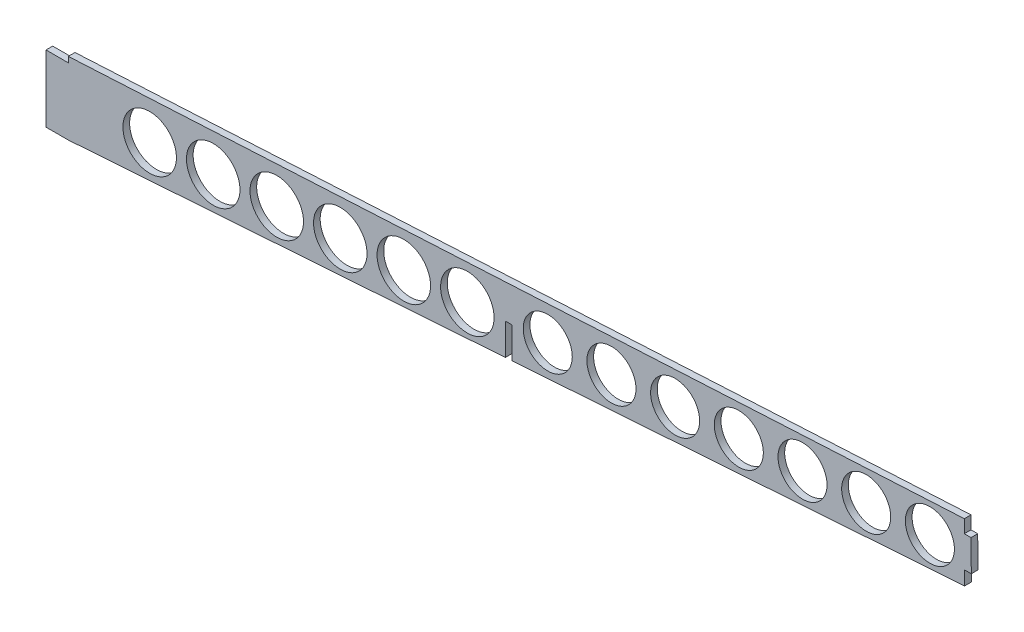
ISO-10303-21;
HEADER;
FILE_DESCRIPTION(('STEP AP214'),'2;1');
FILE_NAME('part.step','',(''),(''),'','','');
FILE_SCHEMA(('AUTOMOTIVE_DESIGN { 1 0 10303 214 1 1 1 1 }'));
ENDSEC;
DATA;
#1=APPLICATION_CONTEXT('core data for automotive mechanical design processes');
#2=APPLICATION_PROTOCOL_DEFINITION('international standard','automotive_design',2000,#1);
#3=PRODUCT_CONTEXT('',#1,'mechanical');
#4=PRODUCT('Part','Part','',(#3));
#5=PRODUCT_RELATED_PRODUCT_CATEGORY('part','',(#4));
#6=PRODUCT_DEFINITION_FORMATION('','',#4);
#7=PRODUCT_DEFINITION_CONTEXT('part definition',#1,'design');
#8=PRODUCT_DEFINITION('design','',#6,#7);
#9=PRODUCT_DEFINITION_SHAPE('','',#8);
#10=(LENGTH_UNIT() NAMED_UNIT(*) SI_UNIT(.MILLI.,.METRE.));
#11=(NAMED_UNIT(*) PLANE_ANGLE_UNIT() SI_UNIT($,.RADIAN.));
#12=(NAMED_UNIT(*) SI_UNIT($,.STERADIAN.) SOLID_ANGLE_UNIT());
#13=UNCERTAINTY_MEASURE_WITH_UNIT(LENGTH_MEASURE(1.E-05),#10,'distance_accuracy_value','');
#14=(GEOMETRIC_REPRESENTATION_CONTEXT(3) GLOBAL_UNCERTAINTY_ASSIGNED_CONTEXT((#13)) GLOBAL_UNIT_ASSIGNED_CONTEXT((#10,
#11,#12)) REPRESENTATION_CONTEXT('',''));
#15=CARTESIAN_POINT('',(0.,0.,0.));
#16=DIRECTION('',(0.,0.,1.));
#17=DIRECTION('',(1.,0.,0.));
#18=AXIS2_PLACEMENT_3D('',#15,#16,#17);
#19=CARTESIAN_POINT('',(-405.,0.,3.));
#20=DIRECTION('',(-0.0690223672970144,0.997615112562313,0.));
#21=DIRECTION('',(-0.997615112562313,-0.0690223672970144,0.));
#22=AXIS2_PLACEMENT_3D('',#19,#20,#21);
#23=PLANE('',#22);
#24=DIRECTION('',(0.997615112562313,0.0690223672970144,0.));
#25=VECTOR('',#24,1.);
#26=CARTESIAN_POINT('',(-405.,0.,0.));
#27=LINE('',#26,#25);
#28=CARTESIAN_POINT('',(-206.,13.7682869065879,0.));
#29=VERTEX_POINT('',#28);
#30=CARTESIAN_POINT('',(-3.059035659361,27.8092387766458,0.));
#31=VERTEX_POINT('',#30);
#32=EDGE_CURVE('E182',#29,#31,#27,.T.);
#33=ORIENTED_EDGE('',*,*,#32,.T.);
#34=DIRECTION('',(0.,0.,1.));
#35=VECTOR('',#34,1.);
#36=CARTESIAN_POINT('',(-3.059035659361,27.8092387766458,-7.));
#37=LINE('',#36,#35);
#38=CARTESIAN_POINT('',(-3.059035659361,27.8092387766458,3.));
#39=VERTEX_POINT('',#38);
#40=EDGE_CURVE('E254',#31,#39,#37,.T.);
#41=ORIENTED_EDGE('',*,*,#40,.T.);
#42=DIRECTION('',(0.997615112562313,0.0690223672970144,0.));
#43=VECTOR('',#42,1.);
#44=CARTESIAN_POINT('',(-405.,0.,3.));
#45=LINE('',#44,#43);
#46=CARTESIAN_POINT('',(-206.,13.7682869065879,3.));
#47=VERTEX_POINT('',#46);
#48=EDGE_CURVE('E234',#47,#39,#45,.T.);
#49=ORIENTED_EDGE('',*,*,#48,.F.);
#50=DIRECTION('',(0.,0.,-1.));
#51=VECTOR('',#50,1.);
#52=CARTESIAN_POINT('',(-206.,13.7682869065879,3.));
#53=LINE('',#52,#51);
#54=EDGE_CURVE('E252',#47,#29,#53,.T.);
#55=ORIENTED_EDGE('',*,*,#54,.T.);
#56=EDGE_LOOP('',(#33,#41,#49,#55));
#57=FACE_BOUND('',#56,.T.);
#58=ADVANCED_FACE('F37',(#57),#23,.F.);
#59=CARTESIAN_POINT('',(-415.,30.,3.));
#60=DIRECTION('',(0.,-1.,0.));
#61=DIRECTION('',(0.,0.,-1.));
#62=AXIS2_PLACEMENT_3D('',#59,#60,#61);
#63=PLANE('',#62);
#64=DIRECTION('',(-1.,0.,0.));
#65=VECTOR('',#64,1.);
#66=CARTESIAN_POINT('',(-415.,30.,0.));
#67=LINE('',#66,#65);
#68=CARTESIAN_POINT('',(-405.,30.,0.));
#69=VERTEX_POINT('',#68);
#70=CARTESIAN_POINT('',(-415.,30.,0.));
#71=VERTEX_POINT('',#70);
#72=EDGE_CURVE('E174',#69,#71,#67,.T.);
#73=ORIENTED_EDGE('',*,*,#72,.T.);
#74=DIRECTION('',(0.,0.,-1.));
#75=VECTOR('',#74,1.);
#76=CARTESIAN_POINT('',(-415.,30.,3.));
#77=LINE('',#76,#75);
#78=CARTESIAN_POINT('',(-415.,30.,3.));
#79=VERTEX_POINT('',#78);
#80=EDGE_CURVE('E203',#79,#71,#77,.T.);
#81=ORIENTED_EDGE('',*,*,#80,.F.);
#82=DIRECTION('',(-1.,0.,0.));
#83=VECTOR('',#82,1.);
#84=CARTESIAN_POINT('',(-415.,30.,3.));
#85=LINE('',#84,#83);
#86=CARTESIAN_POINT('',(-405.,30.,3.));
#87=VERTEX_POINT('',#86);
#88=EDGE_CURVE('E193',#87,#79,#85,.T.);
#89=ORIENTED_EDGE('',*,*,#88,.F.);
#90=DIRECTION('',(0.,0.,-1.));
#91=VECTOR('',#90,1.);
#92=CARTESIAN_POINT('',(-405.,30.,3.));
#93=LINE('',#92,#91);
#94=EDGE_CURVE('E168',#87,#69,#93,.T.);
#95=ORIENTED_EDGE('',*,*,#94,.T.);
#96=EDGE_LOOP('',(#73,#81,#89,#95));
#97=FACE_BOUND('',#96,.T.);
#98=ADVANCED_FACE('F39',(#97),#63,.F.);
#99=CARTESIAN_POINT('',(-415.,0.,3.));
#100=DIRECTION('',(1.,0.,0.));
#101=DIRECTION('',(0.,0.,-1.));
#102=AXIS2_PLACEMENT_3D('',#99,#100,#101);
#103=PLANE('',#102);
#104=DIRECTION('',(0.,-1.,0.));
#105=VECTOR('',#104,1.);
#106=CARTESIAN_POINT('',(-415.,0.,0.));
#107=LINE('',#106,#105);
#108=CARTESIAN_POINT('',(-415.,0.,0.));
#109=VERTEX_POINT('',#108);
#110=EDGE_CURVE('E177',#71,#109,#107,.T.);
#111=ORIENTED_EDGE('',*,*,#110,.T.);
#112=DIRECTION('',(0.,0.,-1.));
#113=VECTOR('',#112,1.);
#114=CARTESIAN_POINT('',(-415.,0.,3.));
#115=LINE('',#114,#113);
#116=CARTESIAN_POINT('',(-415.,0.,3.));
#117=VERTEX_POINT('',#116);
#118=EDGE_CURVE('E200',#117,#109,#115,.T.);
#119=ORIENTED_EDGE('',*,*,#118,.F.);
#120=DIRECTION('',(0.,-1.,0.));
#121=VECTOR('',#120,1.);
#122=CARTESIAN_POINT('',(-415.,0.,3.));
#123=LINE('',#122,#121);
#124=EDGE_CURVE('E225',#79,#117,#123,.T.);
#125=ORIENTED_EDGE('',*,*,#124,.F.);
#126=ORIENTED_EDGE('',*,*,#80,.T.);
#127=EDGE_LOOP('',(#111,#119,#125,#126));
#128=FACE_BOUND('',#127,.T.);
#129=ADVANCED_FACE('F230',(#128),#103,.F.);
#130=CARTESIAN_POINT('',(-415.,0.,3.));
#131=DIRECTION('',(0.,1.,0.));
#132=DIRECTION('',(0.,0.,1.));
#133=AXIS2_PLACEMENT_3D('',#130,#131,#132);
#134=PLANE('',#133);
#135=DIRECTION('',(1.,0.,0.));
#136=VECTOR('',#135,1.);
#137=CARTESIAN_POINT('',(-415.,0.,0.));
#138=LINE('',#137,#136);
#139=CARTESIAN_POINT('',(-405.,0.,0.));
#140=VERTEX_POINT('',#139);
#141=EDGE_CURVE('E180',#109,#140,#138,.T.);
#142=ORIENTED_EDGE('',*,*,#141,.T.);
#143=DIRECTION('',(0.,0.,-1.));
#144=VECTOR('',#143,1.);
#145=CARTESIAN_POINT('',(-405.,0.,3.));
#146=LINE('',#145,#144);
#147=CARTESIAN_POINT('',(-405.,0.,3.));
#148=VERTEX_POINT('',#147);
#149=EDGE_CURVE('E197',#148,#140,#146,.T.);
#150=ORIENTED_EDGE('',*,*,#149,.F.);
#151=DIRECTION('',(1.,0.,0.));
#152=VECTOR('',#151,1.);
#153=CARTESIAN_POINT('',(-415.,0.,3.));
#154=LINE('',#153,#152);
#155=EDGE_CURVE('E232',#117,#148,#154,.T.);
#156=ORIENTED_EDGE('',*,*,#155,.F.);
#157=ORIENTED_EDGE('',*,*,#118,.T.);
#158=EDGE_LOOP('',(#142,#150,#156,#157));
#159=FACE_BOUND('',#158,.T.);
#160=ADVANCED_FACE('F421',(#159),#134,.F.);
#161=CARTESIAN_POINT('',(-209.,13.5607247924182,0.));
#162=VERTEX_POINT('',#161);
#163=EDGE_CURVE('E183',#140,#162,#27,.T.);
#164=ORIENTED_EDGE('',*,*,#163,.T.);
#165=DIRECTION('',(0.,0.,1.));
#166=VECTOR('',#165,1.);
#167=CARTESIAN_POINT('',(-209.,13.5607247924182,0.));
#168=LINE('',#167,#166);
#169=CARTESIAN_POINT('',(-209.,13.5607247924182,3.));
#170=VERTEX_POINT('',#169);
#171=EDGE_CURVE('E310',#162,#170,#168,.T.);
#172=ORIENTED_EDGE('',*,*,#171,.T.);
#173=EDGE_CURVE('E170',#148,#170,#45,.T.);
#174=ORIENTED_EDGE('',*,*,#173,.F.);
#175=ORIENTED_EDGE('',*,*,#149,.T.);
#176=EDGE_LOOP('',(#164,#172,#174,#175));
#177=FACE_BOUND('',#176,.T.);
#178=ADVANCED_FACE('F413',(#177),#23,.F.);
#179=CARTESIAN_POINT('',(-0.255808808264265,54.0196269565569,3.));
#180=DIRECTION('',(-0.999951597832768,-0.00983880031785636,0.));
#181=DIRECTION('',(0.00983880031785636,-0.999951597832768,0.));
#182=AXIS2_PLACEMENT_3D('',#179,#180,#181);
#183=PLANE('',#182);
#184=DIRECTION('',(-0.00983880031785636,0.999951597832768,0.));
#185=VECTOR('',#184,1.);
#186=CARTESIAN_POINT('',(-0.255808808264265,54.0196269565569,0.));
#187=LINE('',#186,#185);
#188=CARTESIAN_POINT('',(-0.0590356593609952,34.0208854129049,0.));
#189=VERTEX_POINT('',#188);
#190=CARTESIAN_POINT('',(-0.19677314890327,48.0196269565569,0.));
#191=VERTEX_POINT('',#190);
#192=EDGE_CURVE('E186',#189,#191,#187,.T.);
#193=ORIENTED_EDGE('',*,*,#192,.T.);
#194=DIRECTION('',(0.,0.,1.));
#195=VECTOR('',#194,1.);
#196=CARTESIAN_POINT('',(-0.19677314890327,48.0196269565569,-7.));
#197=LINE('',#196,#195);
#198=CARTESIAN_POINT('',(-0.19677314890327,48.0196269565569,3.));
#199=VERTEX_POINT('',#198);
#200=EDGE_CURVE('E303',#191,#199,#197,.T.);
#201=ORIENTED_EDGE('',*,*,#200,.T.);
#202=DIRECTION('',(-0.00983880031785636,0.999951597832768,0.));
#203=VECTOR('',#202,1.);
#204=CARTESIAN_POINT('',(-0.255808808264265,54.0196269565569,3.));
#205=LINE('',#204,#203);
#206=CARTESIAN_POINT('',(-0.0590356593609952,34.0208854129049,3.));
#207=VERTEX_POINT('',#206);
#208=EDGE_CURVE('E166',#207,#199,#205,.T.);
#209=ORIENTED_EDGE('',*,*,#208,.F.);
#210=DIRECTION('',(0.,0.,1.));
#211=VECTOR('',#210,1.);
#212=CARTESIAN_POINT('',(-0.0590356593609952,34.0208854129049,-7.));
#213=LINE('',#212,#211);
#214=EDGE_CURVE('E257',#189,#207,#213,.T.);
#215=ORIENTED_EDGE('',*,*,#214,.F.);
#216=EDGE_LOOP('',(#193,#201,#209,#215));
#217=FACE_BOUND('',#216,.T.);
#218=ADVANCED_FACE('F420',(#217),#183,.F.);
#219=CARTESIAN_POINT('',(-405.,32.5,3.));
#220=DIRECTION('',(0.0530934723704851,-0.998589546906858,0.));
#221=DIRECTION('',(0.998589546906858,0.0530934723704851,0.));
#222=AXIS2_PLACEMENT_3D('',#219,#220,#221);
#223=PLANE('',#222);
#224=DIRECTION('',(-0.998589546906858,-0.0530934723704851,0.));
#225=VECTOR('',#224,1.);
#226=CARTESIAN_POINT('',(-405.,32.5,3.));
#227=LINE('',#226,#225);
#228=CARTESIAN_POINT('',(-3.19677314890327,53.8632603999011,3.));
#229=VERTEX_POINT('',#228);
#230=CARTESIAN_POINT('',(-405.,32.5,3.));
#231=VERTEX_POINT('',#230);
#232=EDGE_CURVE('E156',#229,#231,#227,.T.);
#233=ORIENTED_EDGE('',*,*,#232,.F.);
#234=DIRECTION('',(0.,0.,1.));
#235=VECTOR('',#234,1.);
#236=CARTESIAN_POINT('',(-3.19677314890327,53.8632603999011,-7.));
#237=LINE('',#236,#235);
#238=CARTESIAN_POINT('',(-3.19677314890327,53.8632603999011,0.));
#239=VERTEX_POINT('',#238);
#240=EDGE_CURVE('E142',#239,#229,#237,.T.);
#241=ORIENTED_EDGE('',*,*,#240,.F.);
#242=DIRECTION('',(-0.998589546906858,-0.0530934723704851,0.));
#243=VECTOR('',#242,1.);
#244=CARTESIAN_POINT('',(-405.,32.5,0.));
#245=LINE('',#244,#243);
#246=CARTESIAN_POINT('',(-405.,32.5,0.));
#247=VERTEX_POINT('',#246);
#248=EDGE_CURVE('E189',#239,#247,#245,.T.);
#249=ORIENTED_EDGE('',*,*,#248,.T.);
#250=DIRECTION('',(0.,0.,-1.));
#251=VECTOR('',#250,1.);
#252=CARTESIAN_POINT('',(-405.,32.5,3.));
#253=LINE('',#252,#251);
#254=EDGE_CURVE('E163',#231,#247,#253,.T.);
#255=ORIENTED_EDGE('',*,*,#254,.F.);
#256=EDGE_LOOP('',(#233,#241,#249,#255));
#257=FACE_BOUND('',#256,.T.);
#258=ADVANCED_FACE('F161',(#257),#223,.F.);
#259=CARTESIAN_POINT('',(-405.,30.,3.));
#260=DIRECTION('',(1.,0.,0.));
#261=DIRECTION('',(0.,0.,-1.));
#262=AXIS2_PLACEMENT_3D('',#259,#260,#261);
#263=PLANE('',#262);
#264=DIRECTION('',(0.,-1.,0.));
#265=VECTOR('',#264,1.);
#266=CARTESIAN_POINT('',(-405.,30.,0.));
#267=LINE('',#266,#265);
#268=EDGE_CURVE('E191',#247,#69,#267,.T.);
#269=ORIENTED_EDGE('',*,*,#268,.T.);
#270=ORIENTED_EDGE('',*,*,#94,.F.);
#271=DIRECTION('',(0.,-1.,0.));
#272=VECTOR('',#271,1.);
#273=CARTESIAN_POINT('',(-405.,30.,3.));
#274=LINE('',#273,#272);
#275=EDGE_CURVE('E165',#231,#87,#274,.T.);
#276=ORIENTED_EDGE('',*,*,#275,.F.);
#277=ORIENTED_EDGE('',*,*,#254,.T.);
#278=EDGE_LOOP('',(#269,#270,#276,#277));
#279=FACE_BOUND('',#278,.T.);
#280=ADVANCED_FACE('F220',(#279),#263,.F.);
#281=CARTESIAN_POINT('',(0.,0.,3.));
#282=DIRECTION('',(0.,0.,1.));
#283=DIRECTION('',(1.,0.,0.));
#284=AXIS2_PLACEMENT_3D('',#281,#282,#283);
#285=PLANE('',#284);
#286=DIRECTION('',(1.,0.,0.));
#287=VECTOR('',#286,1.);
#288=CARTESIAN_POINT('',(-3.19677314890327,48.0196269565569,3.));
#289=LINE('',#288,#287);
#290=CARTESIAN_POINT('',(-3.19677314890327,48.0196269565569,3.));
#291=VERTEX_POINT('',#290);
#292=EDGE_CURVE('E151',#291,#199,#289,.T.);
#293=ORIENTED_EDGE('',*,*,#292,.F.);
#294=DIRECTION('',(0.,-1.,0.));
#295=VECTOR('',#294,1.);
#296=CARTESIAN_POINT('',(-3.19677314890327,53.8632603999011,3.));
#297=LINE('',#296,#295);
#298=EDGE_CURVE('E145',#229,#291,#297,.T.);
#299=ORIENTED_EDGE('',*,*,#298,.F.);
#300=ORIENTED_EDGE('',*,*,#232,.T.);
#301=ORIENTED_EDGE('',*,*,#275,.T.);
#302=ORIENTED_EDGE('',*,*,#88,.T.);
#303=ORIENTED_EDGE('',*,*,#124,.T.);
#304=ORIENTED_EDGE('',*,*,#155,.T.);
#305=ORIENTED_EDGE('',*,*,#173,.T.);
#306=DIRECTION('',(0.,-1.,0.));
#307=VECTOR('',#306,1.);
#308=CARTESIAN_POINT('',(-209.,0.,3.));
#309=LINE('',#308,#307);
#310=CARTESIAN_POINT('',(-209.,27.6928989485429,3.));
#311=VERTEX_POINT('',#310);
#312=EDGE_CURVE('E320',#311,#170,#309,.T.);
#313=ORIENTED_EDGE('',*,*,#312,.F.);
#314=DIRECTION('',(-1.,0.,0.));
#315=VECTOR('',#314,1.);
#316=CARTESIAN_POINT('',(0.,27.6928989485429,3.));
#317=LINE('',#316,#315);
#318=CARTESIAN_POINT('',(-206.,27.6928989485429,3.));
#319=VERTEX_POINT('',#318);
#320=EDGE_CURVE('E313',#319,#311,#317,.T.);
#321=ORIENTED_EDGE('',*,*,#320,.F.);
#322=DIRECTION('',(0.,1.,0.));
#323=VECTOR('',#322,1.);
#324=CARTESIAN_POINT('',(-206.,0.,3.));
#325=LINE('',#324,#323);
#326=EDGE_CURVE('E247',#47,#319,#325,.T.);
#327=ORIENTED_EDGE('',*,*,#326,.F.);
#328=ORIENTED_EDGE('',*,*,#48,.T.);
#329=DIRECTION('',(0.,-1.,0.));
#330=VECTOR('',#329,1.);
#331=CARTESIAN_POINT('',(-3.059035659361,27.8092387766458,3.));
#332=LINE('',#331,#330);
#333=CARTESIAN_POINT('',(-3.059035659361,34.0208854129049,3.));
#334=VERTEX_POINT('',#333);
#335=EDGE_CURVE('E245',#334,#39,#332,.T.);
#336=ORIENTED_EDGE('',*,*,#335,.F.);
#337=DIRECTION('',(-1.,0.,0.));
#338=VECTOR('',#337,1.);
#339=CARTESIAN_POINT('',(-3.059035659361,34.0208854129049,3.));
#340=LINE('',#339,#338);
#341=EDGE_CURVE('E159',#207,#334,#340,.T.);
#342=ORIENTED_EDGE('',*,*,#341,.F.);
#343=ORIENTED_EDGE('',*,*,#208,.T.);
#344=EDGE_LOOP('',(#293,#299,#300,#301,#302,#303,#304,#305,#313,#321,#327,#328,#336,#342,#343));
#345=FACE_BOUND('',#344,.T.);
#346=CARTESIAN_POINT('',(-18.634713731743,39.8308634725518,3.));
#347=DIRECTION('',(0.,0.,1.));
#348=DIRECTION('',(1.,0.,0.));
#349=AXIS2_PLACEMENT_3D('',#346,#347,#348);
#350=CIRCLE('',#349,11.);
#351=CARTESIAN_POINT('',(-7.63471373174304,39.8308634725518,3.));
#352=VERTEX_POINT('',#351);
#353=EDGE_CURVE('E178',#352,#352,#350,.T.);
#354=ORIENTED_EDGE('',*,*,#353,.F.);
#355=EDGE_LOOP('',(#354));
#356=FACE_BOUND('',#355,.T.);
#357=CARTESIAN_POINT('',(-47.1955947764526,37.995317259985,3.));
#358=DIRECTION('',(0.,0.,1.));
#359=DIRECTION('',(1.,0.,0.));
#360=AXIS2_PLACEMENT_3D('',#357,#358,#359);
#361=CIRCLE('',#360,11.);
#362=CARTESIAN_POINT('',(-36.1955947764526,37.995317259985,3.));
#363=VERTEX_POINT('',#362);
#364=EDGE_CURVE('E357',#363,#363,#361,.T.);
#365=ORIENTED_EDGE('',*,*,#364,.F.);
#366=EDGE_LOOP('',(#365));
#367=FACE_BOUND('',#366,.T.);
#368=CARTESIAN_POINT('',(-75.756475821162,36.1597710474183,3.));
#369=DIRECTION('',(0.,0.,1.));
#370=DIRECTION('',(1.,0.,0.));
#371=AXIS2_PLACEMENT_3D('',#368,#369,#370);
#372=CIRCLE('',#371,11.);
#373=CARTESIAN_POINT('',(-64.7564758211621,36.1597710474183,3.));
#374=VERTEX_POINT('',#373);
#375=EDGE_CURVE('E354',#374,#374,#372,.T.);
#376=ORIENTED_EDGE('',*,*,#375,.F.);
#377=EDGE_LOOP('',(#376));
#378=FACE_BOUND('',#377,.T.);
#379=CARTESIAN_POINT('',(-104.317356865872,34.3242248348515,3.));
#380=DIRECTION('',(0.,0.,1.));
#381=DIRECTION('',(1.,0.,0.));
#382=AXIS2_PLACEMENT_3D('',#379,#380,#381);
#383=CIRCLE('',#382,11.);
#384=CARTESIAN_POINT('',(-93.3173568658715,34.3242248348515,3.));
#385=VERTEX_POINT('',#384);
#386=EDGE_CURVE('E351',#385,#385,#383,.T.);
#387=ORIENTED_EDGE('',*,*,#386,.F.);
#388=EDGE_LOOP('',(#387));
#389=FACE_BOUND('',#388,.T.);
#390=CARTESIAN_POINT('',(-132.878237910581,32.4886786222847,3.));
#391=DIRECTION('',(0.,0.,1.));
#392=DIRECTION('',(1.,0.,0.));
#393=AXIS2_PLACEMENT_3D('',#390,#391,#392);
#394=CIRCLE('',#393,11.);
#395=CARTESIAN_POINT('',(-121.878237910581,32.4886786222847,3.));
#396=VERTEX_POINT('',#395);
#397=EDGE_CURVE('E348',#396,#396,#394,.T.);
#398=ORIENTED_EDGE('',*,*,#397,.F.);
#399=EDGE_LOOP('',(#398));
#400=FACE_BOUND('',#399,.T.);
#401=CARTESIAN_POINT('',(-161.43911895529,30.653132409718,3.));
#402=DIRECTION('',(0.,0.,1.));
#403=DIRECTION('',(1.,0.,0.));
#404=AXIS2_PLACEMENT_3D('',#401,#402,#403);
#405=CIRCLE('',#404,11.);
#406=CARTESIAN_POINT('',(-150.43911895529,30.653132409718,3.));
#407=VERTEX_POINT('',#406);
#408=EDGE_CURVE('E345',#407,#407,#405,.T.);
#409=ORIENTED_EDGE('',*,*,#408,.F.);
#410=EDGE_LOOP('',(#409));
#411=FACE_BOUND('',#410,.T.);
#412=CARTESIAN_POINT('',(-190.,28.8175861971512,3.));
#413=DIRECTION('',(0.,0.,1.));
#414=DIRECTION('',(1.,0.,0.));
#415=AXIS2_PLACEMENT_3D('',#412,#413,#414);
#416=CIRCLE('',#415,11.);
#417=CARTESIAN_POINT('',(-179.,28.8175861971512,3.));
#418=VERTEX_POINT('',#417);
#419=EDGE_CURVE('E342',#418,#418,#416,.T.);
#420=ORIENTED_EDGE('',*,*,#419,.F.);
#421=EDGE_LOOP('',(#420));
#422=FACE_BOUND('',#421,.T.);
#423=CARTESIAN_POINT('',(-226.059717716448,26.5001059283514,3.));
#424=DIRECTION('',(0.,0.,1.));
#425=DIRECTION('',(1.,0.,0.));
#426=AXIS2_PLACEMENT_3D('',#423,#424,#425);
#427=CIRCLE('',#426,12.);
#428=CARTESIAN_POINT('',(-214.059717716448,26.5001059283514,3.));
#429=VERTEX_POINT('',#428);
#430=EDGE_CURVE('E339',#429,#429,#427,.T.);
#431=ORIENTED_EDGE('',*,*,#430,.F.);
#432=EDGE_LOOP('',(#431));
#433=FACE_BOUND('',#432,.T.);
#434=CARTESIAN_POINT('',(-254.549764763706,24.6691120639961,3.));
#435=DIRECTION('',(0.,0.,1.));
#436=DIRECTION('',(1.,0.,0.));
#437=AXIS2_PLACEMENT_3D('',#434,#435,#436);
#438=CIRCLE('',#437,12.);
#439=CARTESIAN_POINT('',(-242.549764763706,24.6691120639961,3.));
#440=VERTEX_POINT('',#439);
#441=EDGE_CURVE('E336',#440,#440,#438,.T.);
#442=ORIENTED_EDGE('',*,*,#441,.F.);
#443=EDGE_LOOP('',(#442));
#444=FACE_BOUND('',#443,.T.);
#445=CARTESIAN_POINT('',(-283.039811810965,22.8381181996408,3.));
#446=DIRECTION('',(0.,0.,1.));
#447=DIRECTION('',(1.,0.,0.));
#448=AXIS2_PLACEMENT_3D('',#445,#446,#447);
#449=CIRCLE('',#448,12.);
#450=CARTESIAN_POINT('',(-271.039811810965,22.8381181996408,3.));
#451=VERTEX_POINT('',#450);
#452=EDGE_CURVE('E333',#451,#451,#449,.T.);
#453=ORIENTED_EDGE('',*,*,#452,.F.);
#454=EDGE_LOOP('',(#453));
#455=FACE_BOUND('',#454,.T.);
#456=CARTESIAN_POINT('',(-311.529858858224,21.0071243352855,3.));
#457=DIRECTION('',(0.,0.,1.));
#458=DIRECTION('',(1.,0.,0.));
#459=AXIS2_PLACEMENT_3D('',#456,#457,#458);
#460=CIRCLE('',#459,12.);
#461=CARTESIAN_POINT('',(-299.529858858224,21.0071243352855,3.));
#462=VERTEX_POINT('',#461);
#463=EDGE_CURVE('E330',#462,#462,#460,.T.);
#464=ORIENTED_EDGE('',*,*,#463,.F.);
#465=EDGE_LOOP('',(#464));
#466=FACE_BOUND('',#465,.T.);
#467=CARTESIAN_POINT('',(-340.019905905483,19.1761304709302,3.));
#468=DIRECTION('',(0.,0.,1.));
#469=DIRECTION('',(1.,0.,0.));
#470=AXIS2_PLACEMENT_3D('',#467,#468,#469);
#471=CIRCLE('',#470,12.);
#472=CARTESIAN_POINT('',(-328.019905905483,19.1761304709302,3.));
#473=VERTEX_POINT('',#472);
#474=EDGE_CURVE('E327',#473,#473,#471,.T.);
#475=ORIENTED_EDGE('',*,*,#474,.F.);
#476=EDGE_LOOP('',(#475));
#477=FACE_BOUND('',#476,.T.);
#478=CARTESIAN_POINT('',(-368.509952952741,17.3451366065749,3.));
#479=DIRECTION('',(0.,0.,1.));
#480=DIRECTION('',(1.,0.,0.));
#481=AXIS2_PLACEMENT_3D('',#478,#479,#480);
#482=CIRCLE('',#481,12.);
#483=CARTESIAN_POINT('',(-356.509952952741,17.3451366065749,3.));
#484=VERTEX_POINT('',#483);
#485=EDGE_CURVE('E324',#484,#484,#482,.T.);
#486=ORIENTED_EDGE('',*,*,#485,.F.);
#487=EDGE_LOOP('',(#486));
#488=FACE_BOUND('',#487,.T.);
#489=ADVANCED_FACE('F154',(#345,#356,#367,#378,#389,#400,#411,#422,#433,#444,#455,#466,#477,
#488),#285,.T.);
#490=CARTESIAN_POINT('',(0.,0.,0.));
#491=DIRECTION('',(0.,0.,1.));
#492=DIRECTION('',(1.,0.,0.));
#493=AXIS2_PLACEMENT_3D('',#490,#491,#492);
#494=PLANE('',#493);
#495=CARTESIAN_POINT('',(-18.634713731743,39.8308634725518,0.));
#496=DIRECTION('',(0.,0.,1.));
#497=DIRECTION('',(1.,0.,0.));
#498=AXIS2_PLACEMENT_3D('',#495,#496,#497);
#499=CIRCLE('',#498,11.);
#500=CARTESIAN_POINT('',(-7.63471373174304,39.8308634725518,0.));
#501=VERTEX_POINT('',#500);
#502=EDGE_CURVE('E300',#501,#501,#499,.T.);
#503=ORIENTED_EDGE('',*,*,#502,.T.);
#504=EDGE_LOOP('',(#503));
#505=FACE_BOUND('',#504,.T.);
#506=CARTESIAN_POINT('',(-47.1955947764526,37.995317259985,0.));
#507=DIRECTION('',(0.,0.,1.));
#508=DIRECTION('',(1.,0.,0.));
#509=AXIS2_PLACEMENT_3D('',#506,#507,#508);
#510=CIRCLE('',#509,11.);
#511=CARTESIAN_POINT('',(-36.1955947764526,37.995317259985,0.));
#512=VERTEX_POINT('',#511);
#513=EDGE_CURVE('E297',#512,#512,#510,.T.);
#514=ORIENTED_EDGE('',*,*,#513,.T.);
#515=EDGE_LOOP('',(#514));
#516=FACE_BOUND('',#515,.T.);
#517=CARTESIAN_POINT('',(-75.756475821162,36.1597710474183,0.));
#518=DIRECTION('',(0.,0.,1.));
#519=DIRECTION('',(1.,0.,0.));
#520=AXIS2_PLACEMENT_3D('',#517,#518,#519);
#521=CIRCLE('',#520,11.);
#522=CARTESIAN_POINT('',(-64.7564758211621,36.1597710474183,0.));
#523=VERTEX_POINT('',#522);
#524=EDGE_CURVE('E294',#523,#523,#521,.T.);
#525=ORIENTED_EDGE('',*,*,#524,.T.);
#526=EDGE_LOOP('',(#525));
#527=FACE_BOUND('',#526,.T.);
#528=CARTESIAN_POINT('',(-104.317356865872,34.3242248348515,0.));
#529=DIRECTION('',(0.,0.,1.));
#530=DIRECTION('',(1.,0.,0.));
#531=AXIS2_PLACEMENT_3D('',#528,#529,#530);
#532=CIRCLE('',#531,11.);
#533=CARTESIAN_POINT('',(-93.3173568658715,34.3242248348515,0.));
#534=VERTEX_POINT('',#533);
#535=EDGE_CURVE('E291',#534,#534,#532,.T.);
#536=ORIENTED_EDGE('',*,*,#535,.T.);
#537=EDGE_LOOP('',(#536));
#538=FACE_BOUND('',#537,.T.);
#539=CARTESIAN_POINT('',(-132.878237910581,32.4886786222847,0.));
#540=DIRECTION('',(0.,0.,1.));
#541=DIRECTION('',(1.,0.,0.));
#542=AXIS2_PLACEMENT_3D('',#539,#540,#541);
#543=CIRCLE('',#542,11.);
#544=CARTESIAN_POINT('',(-121.878237910581,32.4886786222847,0.));
#545=VERTEX_POINT('',#544);
#546=EDGE_CURVE('E288',#545,#545,#543,.T.);
#547=ORIENTED_EDGE('',*,*,#546,.T.);
#548=EDGE_LOOP('',(#547));
#549=FACE_BOUND('',#548,.T.);
#550=CARTESIAN_POINT('',(-161.43911895529,30.653132409718,0.));
#551=DIRECTION('',(0.,0.,1.));
#552=DIRECTION('',(1.,0.,0.));
#553=AXIS2_PLACEMENT_3D('',#550,#551,#552);
#554=CIRCLE('',#553,11.);
#555=CARTESIAN_POINT('',(-150.43911895529,30.653132409718,0.));
#556=VERTEX_POINT('',#555);
#557=EDGE_CURVE('E285',#556,#556,#554,.T.);
#558=ORIENTED_EDGE('',*,*,#557,.T.);
#559=EDGE_LOOP('',(#558));
#560=FACE_BOUND('',#559,.T.);
#561=CARTESIAN_POINT('',(-190.,28.8175861971512,0.));
#562=DIRECTION('',(0.,0.,1.));
#563=DIRECTION('',(1.,0.,0.));
#564=AXIS2_PLACEMENT_3D('',#561,#562,#563);
#565=CIRCLE('',#564,11.);
#566=CARTESIAN_POINT('',(-179.,28.8175861971512,0.));
#567=VERTEX_POINT('',#566);
#568=EDGE_CURVE('E282',#567,#567,#565,.T.);
#569=ORIENTED_EDGE('',*,*,#568,.T.);
#570=EDGE_LOOP('',(#569));
#571=FACE_BOUND('',#570,.T.);
#572=CARTESIAN_POINT('',(-226.059717716448,26.5001059283514,0.));
#573=DIRECTION('',(0.,0.,1.));
#574=DIRECTION('',(1.,0.,0.));
#575=AXIS2_PLACEMENT_3D('',#572,#573,#574);
#576=CIRCLE('',#575,12.);
#577=CARTESIAN_POINT('',(-214.059717716448,26.5001059283514,0.));
#578=VERTEX_POINT('',#577);
#579=EDGE_CURVE('E279',#578,#578,#576,.T.);
#580=ORIENTED_EDGE('',*,*,#579,.T.);
#581=EDGE_LOOP('',(#580));
#582=FACE_BOUND('',#581,.T.);
#583=CARTESIAN_POINT('',(-254.549764763706,24.6691120639961,0.));
#584=DIRECTION('',(0.,0.,1.));
#585=DIRECTION('',(1.,0.,0.));
#586=AXIS2_PLACEMENT_3D('',#583,#584,#585);
#587=CIRCLE('',#586,12.);
#588=CARTESIAN_POINT('',(-242.549764763706,24.6691120639961,0.));
#589=VERTEX_POINT('',#588);
#590=EDGE_CURVE('E276',#589,#589,#587,.T.);
#591=ORIENTED_EDGE('',*,*,#590,.T.);
#592=EDGE_LOOP('',(#591));
#593=FACE_BOUND('',#592,.T.);
#594=CARTESIAN_POINT('',(-283.039811810965,22.8381181996408,0.));
#595=DIRECTION('',(0.,0.,1.));
#596=DIRECTION('',(1.,0.,0.));
#597=AXIS2_PLACEMENT_3D('',#594,#595,#596);
#598=CIRCLE('',#597,12.);
#599=CARTESIAN_POINT('',(-271.039811810965,22.8381181996408,0.));
#600=VERTEX_POINT('',#599);
#601=EDGE_CURVE('E273',#600,#600,#598,.T.);
#602=ORIENTED_EDGE('',*,*,#601,.T.);
#603=EDGE_LOOP('',(#602));
#604=FACE_BOUND('',#603,.T.);
#605=CARTESIAN_POINT('',(-311.529858858224,21.0071243352855,0.));
#606=DIRECTION('',(0.,0.,1.));
#607=DIRECTION('',(1.,0.,0.));
#608=AXIS2_PLACEMENT_3D('',#605,#606,#607);
#609=CIRCLE('',#608,12.);
#610=CARTESIAN_POINT('',(-299.529858858224,21.0071243352855,0.));
#611=VERTEX_POINT('',#610);
#612=EDGE_CURVE('E270',#611,#611,#609,.T.);
#613=ORIENTED_EDGE('',*,*,#612,.T.);
#614=EDGE_LOOP('',(#613));
#615=FACE_BOUND('',#614,.T.);
#616=CARTESIAN_POINT('',(-340.019905905483,19.1761304709302,0.));
#617=DIRECTION('',(0.,0.,1.));
#618=DIRECTION('',(1.,0.,0.));
#619=AXIS2_PLACEMENT_3D('',#616,#617,#618);
#620=CIRCLE('',#619,12.);
#621=CARTESIAN_POINT('',(-328.019905905483,19.1761304709302,0.));
#622=VERTEX_POINT('',#621);
#623=EDGE_CURVE('E267',#622,#622,#620,.T.);
#624=ORIENTED_EDGE('',*,*,#623,.T.);
#625=EDGE_LOOP('',(#624));
#626=FACE_BOUND('',#625,.T.);
#627=CARTESIAN_POINT('',(-368.509952952741,17.3451366065749,0.));
#628=DIRECTION('',(0.,0.,1.));
#629=DIRECTION('',(1.,0.,0.));
#630=AXIS2_PLACEMENT_3D('',#627,#628,#629);
#631=CIRCLE('',#630,12.);
#632=CARTESIAN_POINT('',(-356.509952952741,17.3451366065749,0.));
#633=VERTEX_POINT('',#632);
#634=EDGE_CURVE('E263',#633,#633,#631,.T.);
#635=ORIENTED_EDGE('',*,*,#634,.T.);
#636=EDGE_LOOP('',(#635));
#637=FACE_BOUND('',#636,.T.);
#638=DIRECTION('',(0.,-1.,0.));
#639=VECTOR('',#638,1.);
#640=CARTESIAN_POINT('',(-3.19677314890326,0.,0.));
#641=LINE('',#640,#639);
#642=CARTESIAN_POINT('',(-3.19677314890327,48.0196269565569,0.));
#643=VERTEX_POINT('',#642);
#644=EDGE_CURVE('E45',#239,#643,#641,.T.);
#645=ORIENTED_EDGE('',*,*,#644,.T.);
#646=DIRECTION('',(1.,0.,0.));
#647=VECTOR('',#646,1.);
#648=CARTESIAN_POINT('',(0.,48.0196269565569,0.));
#649=LINE('',#648,#647);
#650=EDGE_CURVE('E11',#643,#191,#649,.T.);
#651=ORIENTED_EDGE('',*,*,#650,.T.);
#652=ORIENTED_EDGE('',*,*,#192,.F.);
#653=DIRECTION('',(-1.,0.,0.));
#654=VECTOR('',#653,1.);
#655=CARTESIAN_POINT('',(0.,34.0208854129049,0.));
#656=LINE('',#655,#654);
#657=CARTESIAN_POINT('',(-3.059035659361,34.0208854129049,0.));
#658=VERTEX_POINT('',#657);
#659=EDGE_CURVE('E209',#189,#658,#656,.T.);
#660=ORIENTED_EDGE('',*,*,#659,.T.);
#661=DIRECTION('',(0.,-1.,0.));
#662=VECTOR('',#661,1.);
#663=CARTESIAN_POINT('',(-3.059035659361,0.,0.));
#664=LINE('',#663,#662);
#665=EDGE_CURVE('E212',#658,#31,#664,.T.);
#666=ORIENTED_EDGE('',*,*,#665,.T.);
#667=ORIENTED_EDGE('',*,*,#32,.F.);
#668=DIRECTION('',(0.,1.,0.));
#669=VECTOR('',#668,1.);
#670=CARTESIAN_POINT('',(-206.,0.,0.));
#671=LINE('',#670,#669);
#672=CARTESIAN_POINT('',(-206.,27.6928989485429,0.));
#673=VERTEX_POINT('',#672);
#674=EDGE_CURVE('E206',#29,#673,#671,.T.);
#675=ORIENTED_EDGE('',*,*,#674,.T.);
#676=DIRECTION('',(-1.,0.,0.));
#677=VECTOR('',#676,1.);
#678=CARTESIAN_POINT('',(-209.,27.6928989485429,0.));
#679=LINE('',#678,#677);
#680=CARTESIAN_POINT('',(-209.,27.6928989485429,0.));
#681=VERTEX_POINT('',#680);
#682=EDGE_CURVE('E266',#673,#681,#679,.T.);
#683=ORIENTED_EDGE('',*,*,#682,.T.);
#684=DIRECTION('',(0.,-1.,0.));
#685=VECTOR('',#684,1.);
#686=CARTESIAN_POINT('',(-209.,27.6928989485429,0.));
#687=LINE('',#686,#685);
#688=EDGE_CURVE('E306',#681,#162,#687,.T.);
#689=ORIENTED_EDGE('',*,*,#688,.T.);
#690=ORIENTED_EDGE('',*,*,#163,.F.);
#691=ORIENTED_EDGE('',*,*,#141,.F.);
#692=ORIENTED_EDGE('',*,*,#110,.F.);
#693=ORIENTED_EDGE('',*,*,#72,.F.);
#694=ORIENTED_EDGE('',*,*,#268,.F.);
#695=ORIENTED_EDGE('',*,*,#248,.F.);
#696=EDGE_LOOP('',(#645,#651,#652,#660,#666,#667,#675,#683,#689,#690,#691,#692,#693,#694,#695));
#697=FACE_BOUND('',#696,.T.);
#698=ADVANCED_FACE('F215',(#505,#516,#527,#538,#549,#560,#571,#582,#593,#604,#615,#626,#637,
#697),#494,.F.);
#699=CARTESIAN_POINT('',(-206.,13.5607247924182,0.));
#700=DIRECTION('',(1.,0.,0.));
#701=DIRECTION('',(0.,0.,-1.));
#702=AXIS2_PLACEMENT_3D('',#699,#700,#701);
#703=PLANE('',#702);
#704=ORIENTED_EDGE('',*,*,#326,.T.);
#705=DIRECTION('',(0.,0.,1.));
#706=VECTOR('',#705,1.);
#707=CARTESIAN_POINT('',(-206.,27.6928989485429,0.));
#708=LINE('',#707,#706);
#709=EDGE_CURVE('E309',#673,#319,#708,.T.);
#710=ORIENTED_EDGE('',*,*,#709,.F.);
#711=ORIENTED_EDGE('',*,*,#674,.F.);
#712=ORIENTED_EDGE('',*,*,#54,.F.);
#713=EDGE_LOOP('',(#704,#710,#711,#712));
#714=FACE_BOUND('',#713,.T.);
#715=ADVANCED_FACE('F400',(#714),#703,.F.);
#716=CARTESIAN_POINT('',(-209.,27.6928989485429,0.));
#717=DIRECTION('',(-1.,0.,0.));
#718=DIRECTION('',(0.,0.,1.));
#719=AXIS2_PLACEMENT_3D('',#716,#717,#718);
#720=PLANE('',#719);
#721=ORIENTED_EDGE('',*,*,#312,.T.);
#722=ORIENTED_EDGE('',*,*,#171,.F.);
#723=ORIENTED_EDGE('',*,*,#688,.F.);
#724=DIRECTION('',(0.,0.,1.));
#725=VECTOR('',#724,1.);
#726=CARTESIAN_POINT('',(-209.,27.6928989485429,0.));
#727=LINE('',#726,#725);
#728=EDGE_CURVE('E314',#681,#311,#727,.T.);
#729=ORIENTED_EDGE('',*,*,#728,.T.);
#730=EDGE_LOOP('',(#721,#722,#723,#729));
#731=FACE_BOUND('',#730,.T.);
#732=ADVANCED_FACE('F406',(#731),#720,.F.);
#733=CARTESIAN_POINT('',(-209.,27.6928989485429,0.));
#734=DIRECTION('',(0.,1.,0.));
#735=DIRECTION('',(0.,0.,1.));
#736=AXIS2_PLACEMENT_3D('',#733,#734,#735);
#737=PLANE('',#736);
#738=ORIENTED_EDGE('',*,*,#320,.T.);
#739=ORIENTED_EDGE('',*,*,#728,.F.);
#740=ORIENTED_EDGE('',*,*,#682,.F.);
#741=ORIENTED_EDGE('',*,*,#709,.T.);
#742=EDGE_LOOP('',(#738,#739,#740,#741));
#743=FACE_BOUND('',#742,.T.);
#744=ADVANCED_FACE('F395',(#743),#737,.F.);
#745=CARTESIAN_POINT('',(-368.509952952741,17.3451366065749,0.));
#746=DIRECTION('',(0.,0.,1.));
#747=DIRECTION('',(1.,0.,0.));
#748=AXIS2_PLACEMENT_3D('',#745,#746,#747);
#749=CYLINDRICAL_SURFACE('',#748,12.);
#750=ORIENTED_EDGE('',*,*,#485,.T.);
#751=EDGE_LOOP('',(#750));
#752=FACE_BOUND('',#751,.T.);
#753=ORIENTED_EDGE('',*,*,#634,.F.);
#754=EDGE_LOOP('',(#753));
#755=FACE_BOUND('',#754,.T.);
#756=ADVANCED_FACE('F391',(#752,#755),#749,.F.);
#757=CARTESIAN_POINT('',(-340.019905905483,19.1761304709302,0.));
#758=DIRECTION('',(0.,0.,1.));
#759=DIRECTION('',(1.,0.,0.));
#760=AXIS2_PLACEMENT_3D('',#757,#758,#759);
#761=CYLINDRICAL_SURFACE('',#760,12.);
#762=ORIENTED_EDGE('',*,*,#474,.T.);
#763=EDGE_LOOP('',(#762));
#764=FACE_BOUND('',#763,.T.);
#765=ORIENTED_EDGE('',*,*,#623,.F.);
#766=EDGE_LOOP('',(#765));
#767=FACE_BOUND('',#766,.T.);
#768=ADVANCED_FACE('F394',(#764,#767),#761,.F.);
#769=CARTESIAN_POINT('',(-311.529858858224,21.0071243352855,0.));
#770=DIRECTION('',(0.,0.,1.));
#771=DIRECTION('',(1.,0.,0.));
#772=AXIS2_PLACEMENT_3D('',#769,#770,#771);
#773=CYLINDRICAL_SURFACE('',#772,12.);
#774=ORIENTED_EDGE('',*,*,#463,.T.);
#775=EDGE_LOOP('',(#774));
#776=FACE_BOUND('',#775,.T.);
#777=ORIENTED_EDGE('',*,*,#612,.F.);
#778=EDGE_LOOP('',(#777));
#779=FACE_BOUND('',#778,.T.);
#780=ADVANCED_FACE('F459',(#776,#779),#773,.F.);
#781=CARTESIAN_POINT('',(-283.039811810965,22.8381181996408,0.));
#782=DIRECTION('',(0.,0.,1.));
#783=DIRECTION('',(1.,0.,0.));
#784=AXIS2_PLACEMENT_3D('',#781,#782,#783);
#785=CYLINDRICAL_SURFACE('',#784,12.);
#786=ORIENTED_EDGE('',*,*,#452,.T.);
#787=EDGE_LOOP('',(#786));
#788=FACE_BOUND('',#787,.T.);
#789=ORIENTED_EDGE('',*,*,#601,.F.);
#790=EDGE_LOOP('',(#789));
#791=FACE_BOUND('',#790,.T.);
#792=ADVANCED_FACE('F463',(#788,#791),#785,.F.);
#793=CARTESIAN_POINT('',(-254.549764763706,24.6691120639961,0.));
#794=DIRECTION('',(0.,0.,1.));
#795=DIRECTION('',(1.,0.,0.));
#796=AXIS2_PLACEMENT_3D('',#793,#794,#795);
#797=CYLINDRICAL_SURFACE('',#796,12.);
#798=ORIENTED_EDGE('',*,*,#441,.T.);
#799=EDGE_LOOP('',(#798));
#800=FACE_BOUND('',#799,.T.);
#801=ORIENTED_EDGE('',*,*,#590,.F.);
#802=EDGE_LOOP('',(#801));
#803=FACE_BOUND('',#802,.T.);
#804=ADVANCED_FACE('F467',(#800,#803),#797,.F.);
#805=CARTESIAN_POINT('',(-226.059717716448,26.5001059283514,0.));
#806=DIRECTION('',(0.,0.,1.));
#807=DIRECTION('',(1.,0.,0.));
#808=AXIS2_PLACEMENT_3D('',#805,#806,#807);
#809=CYLINDRICAL_SURFACE('',#808,12.);
#810=ORIENTED_EDGE('',*,*,#430,.T.);
#811=EDGE_LOOP('',(#810));
#812=FACE_BOUND('',#811,.T.);
#813=ORIENTED_EDGE('',*,*,#579,.F.);
#814=EDGE_LOOP('',(#813));
#815=FACE_BOUND('',#814,.T.);
#816=ADVANCED_FACE('F471',(#812,#815),#809,.F.);
#817=CARTESIAN_POINT('',(-190.,28.8175861971512,0.));
#818=DIRECTION('',(0.,0.,1.));
#819=DIRECTION('',(1.,0.,0.));
#820=AXIS2_PLACEMENT_3D('',#817,#818,#819);
#821=CYLINDRICAL_SURFACE('',#820,11.);
#822=ORIENTED_EDGE('',*,*,#419,.T.);
#823=EDGE_LOOP('',(#822));
#824=FACE_BOUND('',#823,.T.);
#825=ORIENTED_EDGE('',*,*,#568,.F.);
#826=EDGE_LOOP('',(#825));
#827=FACE_BOUND('',#826,.T.);
#828=ADVANCED_FACE('F475',(#824,#827),#821,.F.);
#829=CARTESIAN_POINT('',(-161.43911895529,30.653132409718,0.));
#830=DIRECTION('',(0.,0.,1.));
#831=DIRECTION('',(1.,0.,0.));
#832=AXIS2_PLACEMENT_3D('',#829,#830,#831);
#833=CYLINDRICAL_SURFACE('',#832,11.);
#834=ORIENTED_EDGE('',*,*,#408,.T.);
#835=EDGE_LOOP('',(#834));
#836=FACE_BOUND('',#835,.T.);
#837=ORIENTED_EDGE('',*,*,#557,.F.);
#838=EDGE_LOOP('',(#837));
#839=FACE_BOUND('',#838,.T.);
#840=ADVANCED_FACE('F479',(#836,#839),#833,.F.);
#841=CARTESIAN_POINT('',(-132.878237910581,32.4886786222847,0.));
#842=DIRECTION('',(0.,0.,1.));
#843=DIRECTION('',(1.,0.,0.));
#844=AXIS2_PLACEMENT_3D('',#841,#842,#843);
#845=CYLINDRICAL_SURFACE('',#844,11.);
#846=ORIENTED_EDGE('',*,*,#397,.T.);
#847=EDGE_LOOP('',(#846));
#848=FACE_BOUND('',#847,.T.);
#849=ORIENTED_EDGE('',*,*,#546,.F.);
#850=EDGE_LOOP('',(#849));
#851=FACE_BOUND('',#850,.T.);
#852=ADVANCED_FACE('F483',(#848,#851),#845,.F.);
#853=CARTESIAN_POINT('',(-104.317356865872,34.3242248348515,0.));
#854=DIRECTION('',(0.,0.,1.));
#855=DIRECTION('',(1.,0.,0.));
#856=AXIS2_PLACEMENT_3D('',#853,#854,#855);
#857=CYLINDRICAL_SURFACE('',#856,11.);
#858=ORIENTED_EDGE('',*,*,#386,.T.);
#859=EDGE_LOOP('',(#858));
#860=FACE_BOUND('',#859,.T.);
#861=ORIENTED_EDGE('',*,*,#535,.F.);
#862=EDGE_LOOP('',(#861));
#863=FACE_BOUND('',#862,.T.);
#864=ADVANCED_FACE('F487',(#860,#863),#857,.F.);
#865=CARTESIAN_POINT('',(-75.756475821162,36.1597710474183,0.));
#866=DIRECTION('',(0.,0.,1.));
#867=DIRECTION('',(1.,0.,0.));
#868=AXIS2_PLACEMENT_3D('',#865,#866,#867);
#869=CYLINDRICAL_SURFACE('',#868,11.);
#870=ORIENTED_EDGE('',*,*,#375,.T.);
#871=EDGE_LOOP('',(#870));
#872=FACE_BOUND('',#871,.T.);
#873=ORIENTED_EDGE('',*,*,#524,.F.);
#874=EDGE_LOOP('',(#873));
#875=FACE_BOUND('',#874,.T.);
#876=ADVANCED_FACE('F491',(#872,#875),#869,.F.);
#877=CARTESIAN_POINT('',(-47.1955947764526,37.995317259985,0.));
#878=DIRECTION('',(0.,0.,1.));
#879=DIRECTION('',(1.,0.,0.));
#880=AXIS2_PLACEMENT_3D('',#877,#878,#879);
#881=CYLINDRICAL_SURFACE('',#880,11.);
#882=ORIENTED_EDGE('',*,*,#364,.T.);
#883=EDGE_LOOP('',(#882));
#884=FACE_BOUND('',#883,.T.);
#885=ORIENTED_EDGE('',*,*,#513,.F.);
#886=EDGE_LOOP('',(#885));
#887=FACE_BOUND('',#886,.T.);
#888=ADVANCED_FACE('F495',(#884,#887),#881,.F.);
#889=CARTESIAN_POINT('',(-18.634713731743,39.8308634725518,0.));
#890=DIRECTION('',(0.,0.,1.));
#891=DIRECTION('',(1.,0.,0.));
#892=AXIS2_PLACEMENT_3D('',#889,#890,#891);
#893=CYLINDRICAL_SURFACE('',#892,11.);
#894=ORIENTED_EDGE('',*,*,#353,.T.);
#895=EDGE_LOOP('',(#894));
#896=FACE_BOUND('',#895,.T.);
#897=ORIENTED_EDGE('',*,*,#502,.F.);
#898=EDGE_LOOP('',(#897));
#899=FACE_BOUND('',#898,.T.);
#900=ADVANCED_FACE('F362',(#896,#899),#893,.F.);
#901=CARTESIAN_POINT('',(-3.059035659361,27.8092387766458,-7.));
#902=DIRECTION('',(-1.,0.,0.));
#903=DIRECTION('',(0.,0.,1.));
#904=AXIS2_PLACEMENT_3D('',#901,#902,#903);
#905=PLANE('',#904);
#906=DIRECTION('',(0.,0.,1.));
#907=VECTOR('',#906,1.);
#908=CARTESIAN_POINT('',(-3.059035659361,34.0208854129049,-7.));
#909=LINE('',#908,#907);
#910=EDGE_CURVE('E60',#658,#334,#909,.T.);
#911=ORIENTED_EDGE('',*,*,#910,.T.);
#912=ORIENTED_EDGE('',*,*,#335,.T.);
#913=ORIENTED_EDGE('',*,*,#40,.F.);
#914=ORIENTED_EDGE('',*,*,#665,.F.);
#915=EDGE_LOOP('',(#911,#912,#913,#914));
#916=FACE_BOUND('',#915,.T.);
#917=ADVANCED_FACE('F436',(#916),#905,.F.);
#918=CARTESIAN_POINT('',(-3.059035659361,34.0208854129049,-7.));
#919=DIRECTION('',(0.,1.,0.));
#920=DIRECTION('',(0.,0.,1.));
#921=AXIS2_PLACEMENT_3D('',#918,#919,#920);
#922=PLANE('',#921);
#923=ORIENTED_EDGE('',*,*,#214,.T.);
#924=ORIENTED_EDGE('',*,*,#341,.T.);
#925=ORIENTED_EDGE('',*,*,#910,.F.);
#926=ORIENTED_EDGE('',*,*,#659,.F.);
#927=EDGE_LOOP('',(#923,#924,#925,#926));
#928=FACE_BOUND('',#927,.T.);
#929=ADVANCED_FACE('F437',(#928),#922,.F.);
#930=CARTESIAN_POINT('',(-3.19677314890327,48.0196269565569,-7.));
#931=DIRECTION('',(0.,-1.,0.));
#932=DIRECTION('',(0.,0.,-1.));
#933=AXIS2_PLACEMENT_3D('',#930,#931,#932);
#934=PLANE('',#933);
#935=DIRECTION('',(0.,0.,1.));
#936=VECTOR('',#935,1.);
#937=CARTESIAN_POINT('',(-3.19677314890327,48.0196269565569,-7.));
#938=LINE('',#937,#936);
#939=EDGE_CURVE('E52',#643,#291,#938,.T.);
#940=ORIENTED_EDGE('',*,*,#939,.T.);
#941=ORIENTED_EDGE('',*,*,#292,.T.);
#942=ORIENTED_EDGE('',*,*,#200,.F.);
#943=ORIENTED_EDGE('',*,*,#650,.F.);
#944=EDGE_LOOP('',(#940,#941,#942,#943));
#945=FACE_BOUND('',#944,.T.);
#946=ADVANCED_FACE('F445',(#945),#934,.F.);
#947=CARTESIAN_POINT('',(-3.19677314890327,53.8632603999011,-7.));
#948=DIRECTION('',(-1.,0.,0.));
#949=DIRECTION('',(0.,-1.,0.));
#950=AXIS2_PLACEMENT_3D('',#947,#948,#949);
#951=PLANE('',#950);
#952=ORIENTED_EDGE('',*,*,#240,.T.);
#953=ORIENTED_EDGE('',*,*,#298,.T.);
#954=ORIENTED_EDGE('',*,*,#939,.F.);
#955=ORIENTED_EDGE('',*,*,#644,.F.);
#956=EDGE_LOOP('',(#952,#953,#954,#955));
#957=FACE_BOUND('',#956,.T.);
#958=ADVANCED_FACE('F144',(#957),#951,.F.);
#959=CLOSED_SHELL('',(#58,#98,#129,#160,#178,#218,#258,#280,#489,#698,#715,#732,#744,#756,#768,
#780,#792,#804,#816,#828,#840,#852,#864,#876,#888,#900,#917,#929,#946,#958));
#960=MANIFOLD_SOLID_BREP('B2',#959);
#961=ADVANCED_BREP_SHAPE_REPRESENTATION('',(#18,#960),#14);
#962=SHAPE_DEFINITION_REPRESENTATION(#9,#961);
ENDSEC;
END-ISO-10303-21;
